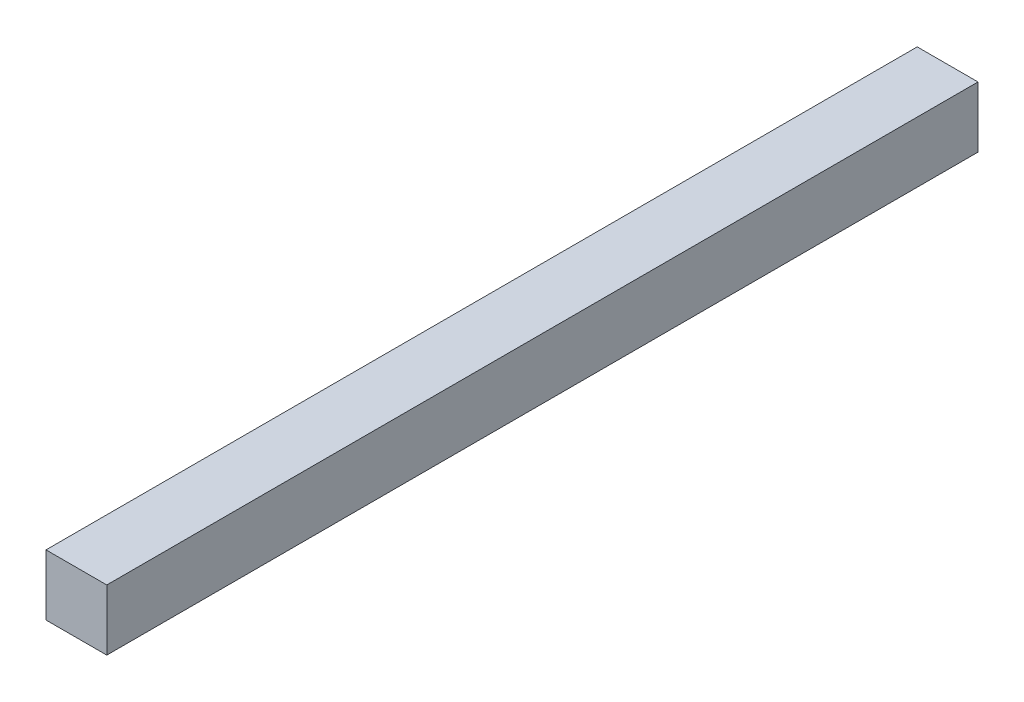
ISO-10303-21;
HEADER;
FILE_DESCRIPTION(('STEP AP214'),'2;1');
FILE_NAME('part.step','',(''),(''),'','','');
FILE_SCHEMA(('AUTOMOTIVE_DESIGN { 1 0 10303 214 1 1 1 1 }'));
ENDSEC;
DATA;
#1=APPLICATION_CONTEXT('core data for automotive mechanical design processes');
#2=APPLICATION_PROTOCOL_DEFINITION('international standard','automotive_design',2000,#1);
#3=PRODUCT_CONTEXT('',#1,'mechanical');
#4=PRODUCT('Part','Part','',(#3));
#5=PRODUCT_RELATED_PRODUCT_CATEGORY('part','',(#4));
#6=PRODUCT_DEFINITION_FORMATION('','',#4);
#7=PRODUCT_DEFINITION_CONTEXT('part definition',#1,'design');
#8=PRODUCT_DEFINITION('design','',#6,#7);
#9=PRODUCT_DEFINITION_SHAPE('','',#8);
#10=(LENGTH_UNIT() NAMED_UNIT(*) SI_UNIT(.MILLI.,.METRE.));
#11=(NAMED_UNIT(*) PLANE_ANGLE_UNIT() SI_UNIT($,.RADIAN.));
#12=(NAMED_UNIT(*) SI_UNIT($,.STERADIAN.) SOLID_ANGLE_UNIT());
#13=UNCERTAINTY_MEASURE_WITH_UNIT(LENGTH_MEASURE(1.E-05),#10,'distance_accuracy_value','');
#14=(GEOMETRIC_REPRESENTATION_CONTEXT(3) GLOBAL_UNCERTAINTY_ASSIGNED_CONTEXT((#13)) GLOBAL_UNIT_ASSIGNED_CONTEXT((#10,
#11,#12)) REPRESENTATION_CONTEXT('',''));
#15=CARTESIAN_POINT('',(0.,0.,0.));
#16=DIRECTION('',(0.,0.,1.));
#17=DIRECTION('',(1.,0.,0.));
#18=AXIS2_PLACEMENT_3D('',#15,#16,#17);
#19=CARTESIAN_POINT('',(0.,0.,-258.));
#20=DIRECTION('',(-1.,0.,0.));
#21=DIRECTION('',(0.,0.,1.));
#22=AXIS2_PLACEMENT_3D('',#19,#20,#21);
#23=PLANE('',#22);
#24=DIRECTION('',(0.,-1.,0.));
#25=VECTOR('',#24,1.);
#26=CARTESIAN_POINT('',(0.,0.,0.));
#27=LINE('',#26,#25);
#28=CARTESIAN_POINT('',(0.,18.,0.));
#29=VERTEX_POINT('',#28);
#30=CARTESIAN_POINT('',(0.,0.,0.));
#31=VERTEX_POINT('',#30);
#32=EDGE_CURVE('E95',#29,#31,#27,.T.);
#33=ORIENTED_EDGE('',*,*,#32,.F.);
#34=DIRECTION('',(0.,0.,1.));
#35=VECTOR('',#34,1.);
#36=CARTESIAN_POINT('',(0.,18.,-258.));
#37=LINE('',#36,#35);
#38=CARTESIAN_POINT('',(0.,18.,-258.));
#39=VERTEX_POINT('',#38);
#40=EDGE_CURVE('E11',#39,#29,#37,.T.);
#41=ORIENTED_EDGE('',*,*,#40,.F.);
#42=DIRECTION('',(0.,-1.,0.));
#43=VECTOR('',#42,1.);
#44=CARTESIAN_POINT('',(0.,0.,-258.));
#45=LINE('',#44,#43);
#46=CARTESIAN_POINT('',(0.,0.,-258.));
#47=VERTEX_POINT('',#46);
#48=EDGE_CURVE('E89',#39,#47,#45,.T.);
#49=ORIENTED_EDGE('',*,*,#48,.T.);
#50=DIRECTION('',(0.,0.,1.));
#51=VECTOR('',#50,1.);
#52=CARTESIAN_POINT('',(0.,0.,-258.));
#53=LINE('',#52,#51);
#54=EDGE_CURVE('E34',#47,#31,#53,.T.);
#55=ORIENTED_EDGE('',*,*,#54,.T.);
#56=EDGE_LOOP('',(#33,#41,#49,#55));
#57=FACE_BOUND('',#56,.T.);
#58=ADVANCED_FACE('F31',(#57),#23,.T.);
#59=CARTESIAN_POINT('',(0.,18.,-258.));
#60=DIRECTION('',(0.,1.,0.));
#61=DIRECTION('',(0.,0.,1.));
#62=AXIS2_PLACEMENT_3D('',#59,#60,#61);
#63=PLANE('',#62);
#64=DIRECTION('',(-1.,0.,0.));
#65=VECTOR('',#64,1.);
#66=CARTESIAN_POINT('',(0.,18.,0.));
#67=LINE('',#66,#65);
#68=CARTESIAN_POINT('',(18.,18.,0.));
#69=VERTEX_POINT('',#68);
#70=EDGE_CURVE('E91',#69,#29,#67,.T.);
#71=ORIENTED_EDGE('',*,*,#70,.F.);
#72=DIRECTION('',(0.,0.,1.));
#73=VECTOR('',#72,1.);
#74=CARTESIAN_POINT('',(18.,18.,-258.));
#75=LINE('',#74,#73);
#76=CARTESIAN_POINT('',(18.,18.,-258.));
#77=VERTEX_POINT('',#76);
#78=EDGE_CURVE('E40',#77,#69,#75,.T.);
#79=ORIENTED_EDGE('',*,*,#78,.F.);
#80=DIRECTION('',(-1.,0.,0.));
#81=VECTOR('',#80,1.);
#82=CARTESIAN_POINT('',(0.,18.,-258.));
#83=LINE('',#82,#81);
#84=EDGE_CURVE('E86',#77,#39,#83,.T.);
#85=ORIENTED_EDGE('',*,*,#84,.T.);
#86=ORIENTED_EDGE('',*,*,#40,.T.);
#87=EDGE_LOOP('',(#71,#79,#85,#86));
#88=FACE_BOUND('',#87,.T.);
#89=ADVANCED_FACE('F105',(#88),#63,.T.);
#90=CARTESIAN_POINT('',(18.,0.,-258.));
#91=DIRECTION('',(1.,0.,0.));
#92=DIRECTION('',(0.,0.,-1.));
#93=AXIS2_PLACEMENT_3D('',#90,#91,#92);
#94=PLANE('',#93);
#95=DIRECTION('',(0.,1.,0.));
#96=VECTOR('',#95,1.);
#97=CARTESIAN_POINT('',(18.,0.,0.));
#98=LINE('',#97,#96);
#99=CARTESIAN_POINT('',(18.,0.,0.));
#100=VERTEX_POINT('',#99);
#101=EDGE_CURVE('E81',#100,#69,#98,.T.);
#102=ORIENTED_EDGE('',*,*,#101,.F.);
#103=DIRECTION('',(0.,0.,1.));
#104=VECTOR('',#103,1.);
#105=CARTESIAN_POINT('',(18.,0.,-258.));
#106=LINE('',#105,#104);
#107=CARTESIAN_POINT('',(18.,0.,-258.));
#108=VERTEX_POINT('',#107);
#109=EDGE_CURVE('E76',#108,#100,#106,.T.);
#110=ORIENTED_EDGE('',*,*,#109,.F.);
#111=DIRECTION('',(0.,1.,0.));
#112=VECTOR('',#111,1.);
#113=CARTESIAN_POINT('',(18.,0.,-258.));
#114=LINE('',#113,#112);
#115=EDGE_CURVE('E79',#108,#77,#114,.T.);
#116=ORIENTED_EDGE('',*,*,#115,.T.);
#117=ORIENTED_EDGE('',*,*,#78,.T.);
#118=EDGE_LOOP('',(#102,#110,#116,#117));
#119=FACE_BOUND('',#118,.T.);
#120=ADVANCED_FACE('F78',(#119),#94,.T.);
#121=CARTESIAN_POINT('',(0.,0.,-258.));
#122=DIRECTION('',(0.,-1.,0.));
#123=DIRECTION('',(0.,0.,-1.));
#124=AXIS2_PLACEMENT_3D('',#121,#122,#123);
#125=PLANE('',#124);
#126=DIRECTION('',(1.,0.,0.));
#127=VECTOR('',#126,1.);
#128=CARTESIAN_POINT('',(0.,0.,0.));
#129=LINE('',#128,#127);
#130=EDGE_CURVE('E98',#31,#100,#129,.T.);
#131=ORIENTED_EDGE('',*,*,#130,.F.);
#132=ORIENTED_EDGE('',*,*,#54,.F.);
#133=DIRECTION('',(1.,0.,0.));
#134=VECTOR('',#133,1.);
#135=CARTESIAN_POINT('',(0.,0.,-258.));
#136=LINE('',#135,#134);
#137=EDGE_CURVE('E85',#47,#108,#136,.T.);
#138=ORIENTED_EDGE('',*,*,#137,.T.);
#139=ORIENTED_EDGE('',*,*,#109,.T.);
#140=EDGE_LOOP('',(#131,#132,#138,#139));
#141=FACE_BOUND('',#140,.T.);
#142=ADVANCED_FACE('F88',(#141),#125,.T.);
#143=CARTESIAN_POINT('',(0.,18.,-258.));
#144=DIRECTION('',(0.,0.,-1.));
#145=DIRECTION('',(-1.,0.,0.));
#146=AXIS2_PLACEMENT_3D('',#143,#144,#145);
#147=PLANE('',#146);
#148=ORIENTED_EDGE('',*,*,#48,.F.);
#149=ORIENTED_EDGE('',*,*,#84,.F.);
#150=ORIENTED_EDGE('',*,*,#115,.F.);
#151=ORIENTED_EDGE('',*,*,#137,.F.);
#152=EDGE_LOOP('',(#148,#149,#150,#151));
#153=FACE_BOUND('',#152,.T.);
#154=ADVANCED_FACE('F84',(#153),#147,.T.);
#155=CARTESIAN_POINT('',(0.,18.,0.));
#156=DIRECTION('',(0.,0.,-1.));
#157=DIRECTION('',(-1.,0.,0.));
#158=AXIS2_PLACEMENT_3D('',#155,#156,#157);
#159=PLANE('',#158);
#160=ORIENTED_EDGE('',*,*,#32,.T.);
#161=ORIENTED_EDGE('',*,*,#130,.T.);
#162=ORIENTED_EDGE('',*,*,#101,.T.);
#163=ORIENTED_EDGE('',*,*,#70,.T.);
#164=EDGE_LOOP('',(#160,#161,#162,#163));
#165=FACE_BOUND('',#164,.T.);
#166=ADVANCED_FACE('F104',(#165),#159,.F.);
#167=CLOSED_SHELL('',(#58,#89,#120,#142,#154,#166));
#168=MANIFOLD_SOLID_BREP('B2',#167);
#169=ADVANCED_BREP_SHAPE_REPRESENTATION('',(#18,#168),#14);
#170=SHAPE_DEFINITION_REPRESENTATION(#9,#169);
ENDSEC;
END-ISO-10303-21;
